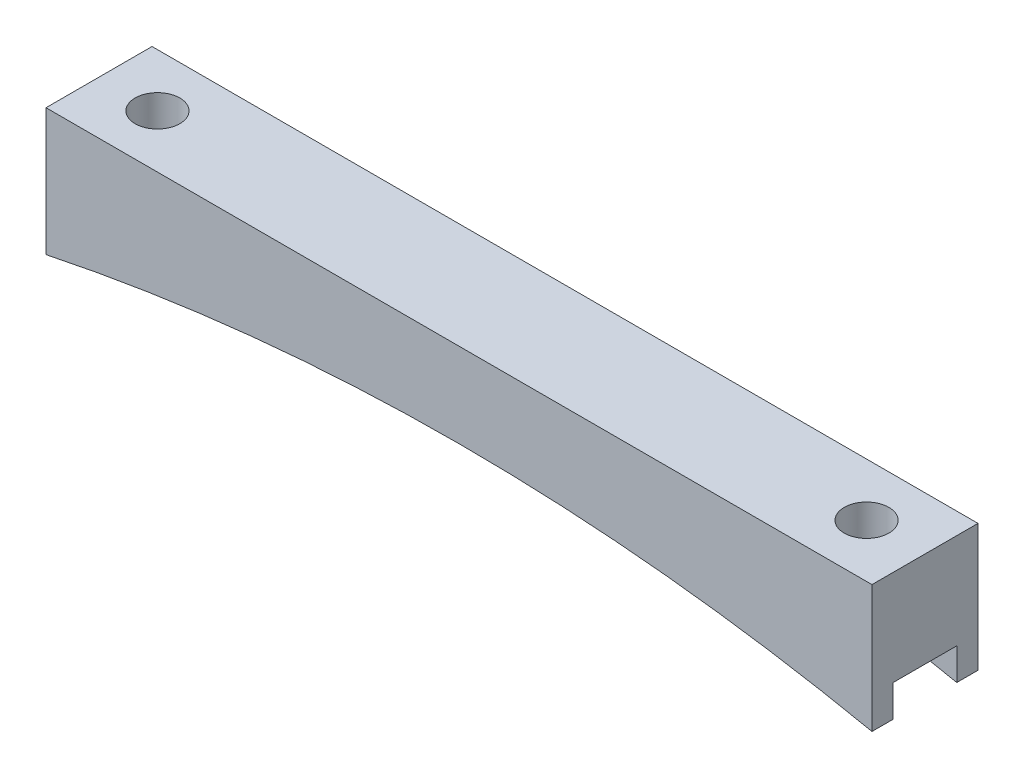
ISO-10303-21;
HEADER;
FILE_DESCRIPTION(('STEP AP214'),'2;1');
FILE_NAME('part.step','',(''),(''),'','','');
FILE_SCHEMA(('AUTOMOTIVE_DESIGN { 1 0 10303 214 1 1 1 1 }'));
ENDSEC;
DATA;
#1=APPLICATION_CONTEXT('core data for automotive mechanical design processes');
#2=APPLICATION_PROTOCOL_DEFINITION('international standard','automotive_design',2000,#1);
#3=PRODUCT_CONTEXT('',#1,'mechanical');
#4=PRODUCT('Part','Part','',(#3));
#5=PRODUCT_RELATED_PRODUCT_CATEGORY('part','',(#4));
#6=PRODUCT_DEFINITION_FORMATION('','',#4);
#7=PRODUCT_DEFINITION_CONTEXT('part definition',#1,'design');
#8=PRODUCT_DEFINITION('design','',#6,#7);
#9=PRODUCT_DEFINITION_SHAPE('','',#8);
#10=(LENGTH_UNIT() NAMED_UNIT(*) SI_UNIT(.MILLI.,.METRE.));
#11=(NAMED_UNIT(*) PLANE_ANGLE_UNIT() SI_UNIT($,.RADIAN.));
#12=(NAMED_UNIT(*) SI_UNIT($,.STERADIAN.) SOLID_ANGLE_UNIT());
#13=UNCERTAINTY_MEASURE_WITH_UNIT(LENGTH_MEASURE(1.E-05),#10,'distance_accuracy_value','');
#14=(GEOMETRIC_REPRESENTATION_CONTEXT(3) GLOBAL_UNCERTAINTY_ASSIGNED_CONTEXT((#13)) GLOBAL_UNIT_ASSIGNED_CONTEXT((#10,
#11,#12)) REPRESENTATION_CONTEXT('',''));
#15=CARTESIAN_POINT('',(0.,0.,0.));
#16=DIRECTION('',(0.,0.,1.));
#17=DIRECTION('',(1.,0.,0.));
#18=AXIS2_PLACEMENT_3D('',#15,#16,#17);
#19=CARTESIAN_POINT('',(49.465,0.,12.7));
#20=DIRECTION('',(-1.,0.,0.));
#21=DIRECTION('',(0.,-1.,0.));
#22=AXIS2_PLACEMENT_3D('',#19,#20,#21);
#23=PLANE('',#22);
#24=DIRECTION('',(0.,0.,-1.));
#25=VECTOR('',#24,1.);
#26=CARTESIAN_POINT('',(49.465,-15.24,12.7));
#27=LINE('',#26,#25);
#28=CARTESIAN_POINT('',(49.465,-15.24,12.7));
#29=VERTEX_POINT('',#28);
#30=CARTESIAN_POINT('',(49.465,-15.24,10.16));
#31=VERTEX_POINT('',#30);
#32=EDGE_CURVE('E156',#29,#31,#27,.T.);
#33=ORIENTED_EDGE('',*,*,#32,.T.);
#34=DIRECTION('',(0.,-1.,0.));
#35=VECTOR('',#34,1.);
#36=CARTESIAN_POINT('',(49.465,-15.24,10.16));
#37=LINE('',#36,#35);
#38=CARTESIAN_POINT('',(49.465,-11.43,10.16));
#39=VERTEX_POINT('',#38);
#40=EDGE_CURVE('E185',#39,#31,#37,.T.);
#41=ORIENTED_EDGE('',*,*,#40,.F.);
#42=DIRECTION('',(0.,0.,1.));
#43=VECTOR('',#42,1.);
#44=CARTESIAN_POINT('',(49.465,-11.43,10.16));
#45=LINE('',#44,#43);
#46=CARTESIAN_POINT('',(49.465,-11.43,2.54));
#47=VERTEX_POINT('',#46);
#48=EDGE_CURVE('E141',#47,#39,#45,.T.);
#49=ORIENTED_EDGE('',*,*,#48,.F.);
#50=DIRECTION('',(0.,1.,0.));
#51=VECTOR('',#50,1.);
#52=CARTESIAN_POINT('',(49.465,-15.24,2.54));
#53=LINE('',#52,#51);
#54=CARTESIAN_POINT('',(49.465,-15.24,2.54));
#55=VERTEX_POINT('',#54);
#56=EDGE_CURVE('E177',#55,#47,#53,.T.);
#57=ORIENTED_EDGE('',*,*,#56,.F.);
#58=CARTESIAN_POINT('',(49.465,-15.24,0.));
#59=VERTEX_POINT('',#58);
#60=EDGE_CURVE('E174',#55,#59,#27,.T.);
#61=ORIENTED_EDGE('',*,*,#60,.T.);
#62=DIRECTION('',(0.,1.,0.));
#63=VECTOR('',#62,1.);
#64=CARTESIAN_POINT('',(49.465,0.,0.));
#65=LINE('',#64,#63);
#66=CARTESIAN_POINT('',(49.465,0.,0.));
#67=VERTEX_POINT('',#66);
#68=EDGE_CURVE('E213',#59,#67,#65,.T.);
#69=ORIENTED_EDGE('',*,*,#68,.T.);
#70=DIRECTION('',(0.,0.,-1.));
#71=VECTOR('',#70,1.);
#72=CARTESIAN_POINT('',(49.465,0.,12.7));
#73=LINE('',#72,#71);
#74=CARTESIAN_POINT('',(49.465,0.,12.7));
#75=VERTEX_POINT('',#74);
#76=EDGE_CURVE('E154',#75,#67,#73,.T.);
#77=ORIENTED_EDGE('',*,*,#76,.F.);
#78=DIRECTION('',(0.,1.,0.));
#79=VECTOR('',#78,1.);
#80=CARTESIAN_POINT('',(49.465,0.,12.7));
#81=LINE('',#80,#79);
#82=EDGE_CURVE('E217',#29,#75,#81,.T.);
#83=ORIENTED_EDGE('',*,*,#82,.F.);
#84=EDGE_LOOP('',(#33,#41,#49,#57,#61,#69,#77,#83));
#85=FACE_BOUND('',#84,.T.);
#86=ADVANCED_FACE('F43',(#85),#23,.F.);
#87=CARTESIAN_POINT('',(-49.465,0.,12.7));
#88=DIRECTION('',(0.,-1.,0.));
#89=DIRECTION('',(1.,0.,0.));
#90=AXIS2_PLACEMENT_3D('',#87,#88,#89);
#91=PLANE('',#90);
#92=CARTESIAN_POINT('',(-42.465,0.,6.35));
#93=DIRECTION('',(0.,1.,0.));
#94=DIRECTION('',(-1.,0.,0.));
#95=AXIS2_PLACEMENT_3D('',#92,#93,#94);
#96=CIRCLE('',#95,2.675);
#97=CARTESIAN_POINT('',(-45.14,0.,6.35));
#98=VERTEX_POINT('',#97);
#99=EDGE_CURVE('E209',#98,#98,#96,.T.);
#100=ORIENTED_EDGE('',*,*,#99,.F.);
#101=EDGE_LOOP('',(#100));
#102=FACE_BOUND('',#101,.T.);
#103=CARTESIAN_POINT('',(42.465,0.,6.35));
#104=DIRECTION('',(0.,1.,0.));
#105=DIRECTION('',(-1.,0.,0.));
#106=AXIS2_PLACEMENT_3D('',#103,#104,#105);
#107=CIRCLE('',#106,2.675);
#108=CARTESIAN_POINT('',(39.79,0.,6.35));
#109=VERTEX_POINT('',#108);
#110=EDGE_CURVE('E208',#109,#109,#107,.T.);
#111=ORIENTED_EDGE('',*,*,#110,.F.);
#112=EDGE_LOOP('',(#111));
#113=FACE_BOUND('',#112,.T.);
#114=DIRECTION('',(-1.,0.,0.));
#115=VECTOR('',#114,1.);
#116=CARTESIAN_POINT('',(-49.465,0.,0.));
#117=LINE('',#116,#115);
#118=CARTESIAN_POINT('',(-49.465,0.,0.));
#119=VERTEX_POINT('',#118);
#120=EDGE_CURVE('E232',#67,#119,#117,.T.);
#121=ORIENTED_EDGE('',*,*,#120,.T.);
#122=DIRECTION('',(0.,0.,-1.));
#123=VECTOR('',#122,1.);
#124=CARTESIAN_POINT('',(-49.465,0.,12.7));
#125=LINE('',#124,#123);
#126=CARTESIAN_POINT('',(-49.465,0.,12.7));
#127=VERTEX_POINT('',#126);
#128=EDGE_CURVE('E148',#127,#119,#125,.T.);
#129=ORIENTED_EDGE('',*,*,#128,.F.);
#130=DIRECTION('',(-1.,0.,0.));
#131=VECTOR('',#130,1.);
#132=CARTESIAN_POINT('',(-49.465,0.,12.7));
#133=LINE('',#132,#131);
#134=EDGE_CURVE('E221',#75,#127,#133,.T.);
#135=ORIENTED_EDGE('',*,*,#134,.F.);
#136=ORIENTED_EDGE('',*,*,#76,.T.);
#137=EDGE_LOOP('',(#121,#129,#135,#136));
#138=FACE_BOUND('',#137,.T.);
#139=ADVANCED_FACE('F247',(#102,#113,#138),#91,.F.);
#140=CARTESIAN_POINT('',(-49.465,0.,12.7));
#141=DIRECTION('',(1.,0.,0.));
#142=DIRECTION('',(0.,1.,0.));
#143=AXIS2_PLACEMENT_3D('',#140,#141,#142);
#144=PLANE('',#143);
#145=DIRECTION('',(0.,0.,1.));
#146=VECTOR('',#145,1.);
#147=CARTESIAN_POINT('',(-49.465,-11.43,10.16));
#148=LINE('',#147,#146);
#149=CARTESIAN_POINT('',(-49.465,-11.43,2.54));
#150=VERTEX_POINT('',#149);
#151=CARTESIAN_POINT('',(-49.465,-11.43,10.16));
#152=VERTEX_POINT('',#151);
#153=EDGE_CURVE('E139',#150,#152,#148,.T.);
#154=ORIENTED_EDGE('',*,*,#153,.T.);
#155=DIRECTION('',(0.,-1.,0.));
#156=VECTOR('',#155,1.);
#157=CARTESIAN_POINT('',(-49.465,-15.24,10.16));
#158=LINE('',#157,#156);
#159=CARTESIAN_POINT('',(-49.465,-15.24,10.16));
#160=VERTEX_POINT('',#159);
#161=EDGE_CURVE('E124',#152,#160,#158,.T.);
#162=ORIENTED_EDGE('',*,*,#161,.T.);
#163=DIRECTION('',(0.,0.,-1.));
#164=VECTOR('',#163,1.);
#165=CARTESIAN_POINT('',(-49.465,-15.24,12.7));
#166=LINE('',#165,#164);
#167=CARTESIAN_POINT('',(-49.465,-15.24,12.7));
#168=VERTEX_POINT('',#167);
#169=EDGE_CURVE('E136',#168,#160,#166,.T.);
#170=ORIENTED_EDGE('',*,*,#169,.F.);
#171=DIRECTION('',(0.,-1.,0.));
#172=VECTOR('',#171,1.);
#173=CARTESIAN_POINT('',(-49.465,0.,12.7));
#174=LINE('',#173,#172);
#175=EDGE_CURVE('E225',#127,#168,#174,.T.);
#176=ORIENTED_EDGE('',*,*,#175,.F.);
#177=ORIENTED_EDGE('',*,*,#128,.T.);
#178=DIRECTION('',(0.,-1.,0.));
#179=VECTOR('',#178,1.);
#180=CARTESIAN_POINT('',(-49.465,0.,0.));
#181=LINE('',#180,#179);
#182=CARTESIAN_POINT('',(-49.465,-15.24,0.));
#183=VERTEX_POINT('',#182);
#184=EDGE_CURVE('E235',#119,#183,#181,.T.);
#185=ORIENTED_EDGE('',*,*,#184,.T.);
#186=CARTESIAN_POINT('',(-49.465,-15.24,2.54));
#187=VERTEX_POINT('',#186);
#188=EDGE_CURVE('E149',#187,#183,#166,.T.);
#189=ORIENTED_EDGE('',*,*,#188,.F.);
#190=DIRECTION('',(0.,1.,0.));
#191=VECTOR('',#190,1.);
#192=CARTESIAN_POINT('',(-49.465,-15.24,2.54));
#193=LINE('',#192,#191);
#194=EDGE_CURVE('E67',#187,#150,#193,.T.);
#195=ORIENTED_EDGE('',*,*,#194,.T.);
#196=EDGE_LOOP('',(#154,#162,#170,#176,#177,#185,#189,#195));
#197=FACE_BOUND('',#196,.T.);
#198=ADVANCED_FACE('F134',(#197),#144,.F.);
#199=CARTESIAN_POINT('',(0.,-251.415578278111,12.7));
#200=DIRECTION('',(0.,0.,-1.));
#201=DIRECTION('',(-1.,0.,0.));
#202=AXIS2_PLACEMENT_3D('',#199,#200,#201);
#203=CYLINDRICAL_SURFACE('',#202,241.3);
#204=DIRECTION('',(0.,0.,-1.));
#205=VECTOR('',#204,1.);
#206=CARTESIAN_POINT('',(25.1517836051595,-11.4299999999999,12.7));
#207=LINE('',#206,#205);
#208=CARTESIAN_POINT('',(25.1517836051595,-11.4299999999999,2.54));
#209=VERTEX_POINT('',#208);
#210=CARTESIAN_POINT('',(25.1517836051595,-11.43,10.16));
#211=VERTEX_POINT('',#210);
#212=EDGE_CURVE('E172',#209,#211,#207,.F.);
#213=ORIENTED_EDGE('',*,*,#212,.T.);
#214=CARTESIAN_POINT('',(0.,-251.415578278111,10.16));
#215=DIRECTION('',(0.,0.,1.));
#216=DIRECTION('',(1.,0.,0.));
#217=AXIS2_PLACEMENT_3D('',#214,#215,#216);
#218=CIRCLE('',#217,241.3);
#219=EDGE_CURVE('E11',#211,#31,#218,.F.);
#220=ORIENTED_EDGE('',*,*,#219,.T.);
#221=ORIENTED_EDGE('',*,*,#32,.F.);
#222=CARTESIAN_POINT('',(0.,-251.415578278111,12.7));
#223=DIRECTION('',(0.,0.,-1.));
#224=DIRECTION('',(-1.,0.,0.));
#225=AXIS2_PLACEMENT_3D('',#222,#223,#224);
#226=CIRCLE('',#225,241.3);
#227=EDGE_CURVE('E146',#168,#29,#226,.T.);
#228=ORIENTED_EDGE('',*,*,#227,.F.);
#229=ORIENTED_EDGE('',*,*,#169,.T.);
#230=CARTESIAN_POINT('',(-25.1517836051595,-11.43,10.16));
#231=VERTEX_POINT('',#230);
#232=EDGE_CURVE('E46',#160,#231,#218,.F.);
#233=ORIENTED_EDGE('',*,*,#232,.T.);
#234=DIRECTION('',(0.,0.,-1.));
#235=VECTOR('',#234,1.);
#236=CARTESIAN_POINT('',(-25.1517836051595,-11.4299999999999,12.7));
#237=LINE('',#236,#235);
#238=CARTESIAN_POINT('',(-25.1517836051595,-11.4299999999999,2.54));
#239=VERTEX_POINT('',#238);
#240=EDGE_CURVE('E203',#231,#239,#237,.T.);
#241=ORIENTED_EDGE('',*,*,#240,.T.);
#242=CARTESIAN_POINT('',(0.,-251.415578278111,2.54));
#243=DIRECTION('',(0.,0.,-1.));
#244=DIRECTION('',(-1.,0.,0.));
#245=AXIS2_PLACEMENT_3D('',#242,#243,#244);
#246=CIRCLE('',#245,241.3);
#247=EDGE_CURVE('E131',#239,#187,#246,.F.);
#248=ORIENTED_EDGE('',*,*,#247,.T.);
#249=ORIENTED_EDGE('',*,*,#188,.T.);
#250=CARTESIAN_POINT('',(0.,-251.415578278111,0.));
#251=DIRECTION('',(0.,0.,-1.));
#252=DIRECTION('',(-1.,0.,0.));
#253=AXIS2_PLACEMENT_3D('',#250,#251,#252);
#254=CIRCLE('',#253,241.3);
#255=EDGE_CURVE('E222',#183,#59,#254,.T.);
#256=ORIENTED_EDGE('',*,*,#255,.T.);
#257=ORIENTED_EDGE('',*,*,#60,.F.);
#258=EDGE_CURVE('E52',#55,#209,#246,.F.);
#259=ORIENTED_EDGE('',*,*,#258,.T.);
#260=EDGE_LOOP('',(#213,#220,#221,#228,#229,#233,#241,#248,#249,#256,#257,#259));
#261=FACE_BOUND('',#260,.T.);
#262=ADVANCED_FACE('F144',(#261),#203,.F.);
#263=CARTESIAN_POINT('',(0.,-251.415578278111,12.7));
#264=DIRECTION('',(0.,0.,-1.));
#265=DIRECTION('',(-1.,0.,0.));
#266=AXIS2_PLACEMENT_3D('',#263,#264,#265);
#267=PLANE('',#266);
#268=ORIENTED_EDGE('',*,*,#82,.T.);
#269=ORIENTED_EDGE('',*,*,#134,.T.);
#270=ORIENTED_EDGE('',*,*,#175,.T.);
#271=ORIENTED_EDGE('',*,*,#227,.T.);
#272=EDGE_LOOP('',(#268,#269,#270,#271));
#273=FACE_BOUND('',#272,.T.);
#274=ADVANCED_FACE('F250',(#273),#267,.F.);
#275=CARTESIAN_POINT('',(0.,-251.415578278111,0.));
#276=DIRECTION('',(0.,0.,-1.));
#277=DIRECTION('',(-1.,0.,0.));
#278=AXIS2_PLACEMENT_3D('',#275,#276,#277);
#279=PLANE('',#278);
#280=ORIENTED_EDGE('',*,*,#68,.F.);
#281=ORIENTED_EDGE('',*,*,#255,.F.);
#282=ORIENTED_EDGE('',*,*,#184,.F.);
#283=ORIENTED_EDGE('',*,*,#120,.F.);
#284=EDGE_LOOP('',(#280,#281,#282,#283));
#285=FACE_BOUND('',#284,.T.);
#286=ADVANCED_FACE('F243',(#285),#279,.T.);
#287=CARTESIAN_POINT('',(42.465,-15.24,6.35));
#288=DIRECTION('',(0.,1.,0.));
#289=DIRECTION('',(-1.,0.,0.));
#290=AXIS2_PLACEMENT_3D('',#287,#288,#289);
#291=CYLINDRICAL_SURFACE('',#290,2.675);
#292=CARTESIAN_POINT('',(42.465,-11.43,6.35));
#293=DIRECTION('',(0.,1.,0.));
#294=DIRECTION('',(0.,0.,1.));
#295=AXIS2_PLACEMENT_3D('',#292,#293,#294);
#296=CIRCLE('',#295,2.675);
#297=CARTESIAN_POINT('',(42.465,-11.43,9.025));
#298=VERTEX_POINT('',#297);
#299=EDGE_CURVE('E166',#298,#298,#296,.F.);
#300=ORIENTED_EDGE('',*,*,#299,.T.);
#301=EDGE_LOOP('',(#300));
#302=FACE_BOUND('',#301,.T.);
#303=ORIENTED_EDGE('',*,*,#110,.T.);
#304=EDGE_LOOP('',(#303));
#305=FACE_BOUND('',#304,.T.);
#306=ADVANCED_FACE('F292',(#302,#305),#291,.F.);
#307=CARTESIAN_POINT('',(-42.465,-15.24,6.35));
#308=DIRECTION('',(0.,1.,0.));
#309=DIRECTION('',(-1.,0.,0.));
#310=AXIS2_PLACEMENT_3D('',#307,#308,#309);
#311=CYLINDRICAL_SURFACE('',#310,2.675);
#312=CARTESIAN_POINT('',(-42.465,-11.43,6.35));
#313=DIRECTION('',(0.,1.,0.));
#314=DIRECTION('',(0.,0.,1.));
#315=AXIS2_PLACEMENT_3D('',#312,#313,#314);
#316=CIRCLE('',#315,2.675);
#317=CARTESIAN_POINT('',(-42.465,-11.43,9.025));
#318=VERTEX_POINT('',#317);
#319=EDGE_CURVE('E163',#318,#318,#316,.F.);
#320=ORIENTED_EDGE('',*,*,#319,.T.);
#321=EDGE_LOOP('',(#320));
#322=FACE_BOUND('',#321,.T.);
#323=ORIENTED_EDGE('',*,*,#99,.T.);
#324=EDGE_LOOP('',(#323));
#325=FACE_BOUND('',#324,.T.);
#326=ADVANCED_FACE('F274',(#322,#325),#311,.F.);
#327=CARTESIAN_POINT('',(-49.465,-11.43,10.16));
#328=DIRECTION('',(0.,1.,0.));
#329=DIRECTION('',(0.,0.,1.));
#330=AXIS2_PLACEMENT_3D('',#327,#328,#329);
#331=PLANE('',#330);
#332=ORIENTED_EDGE('',*,*,#319,.F.);
#333=EDGE_LOOP('',(#332));
#334=FACE_BOUND('',#333,.T.);
#335=DIRECTION('',(1.,0.,0.));
#336=VECTOR('',#335,1.);
#337=CARTESIAN_POINT('',(-49.465,-11.43,10.16));
#338=LINE('',#337,#336);
#339=EDGE_CURVE('E126',#152,#231,#338,.T.);
#340=ORIENTED_EDGE('',*,*,#339,.F.);
#341=ORIENTED_EDGE('',*,*,#153,.F.);
#342=DIRECTION('',(1.,0.,0.));
#343=VECTOR('',#342,1.);
#344=CARTESIAN_POINT('',(-49.465,-11.43,2.54));
#345=LINE('',#344,#343);
#346=EDGE_CURVE('E196',#150,#239,#345,.T.);
#347=ORIENTED_EDGE('',*,*,#346,.T.);
#348=ORIENTED_EDGE('',*,*,#240,.F.);
#349=EDGE_LOOP('',(#340,#341,#347,#348));
#350=FACE_BOUND('',#349,.T.);
#351=ADVANCED_FACE('F266',(#334,#350),#331,.F.);
#352=CARTESIAN_POINT('',(-49.465,-15.24,2.54));
#353=DIRECTION('',(0.,0.,-1.));
#354=DIRECTION('',(-1.,0.,0.));
#355=AXIS2_PLACEMENT_3D('',#352,#353,#354);
#356=PLANE('',#355);
#357=ORIENTED_EDGE('',*,*,#346,.F.);
#358=ORIENTED_EDGE('',*,*,#194,.F.);
#359=ORIENTED_EDGE('',*,*,#247,.F.);
#360=EDGE_LOOP('',(#357,#358,#359));
#361=FACE_BOUND('',#360,.T.);
#362=ADVANCED_FACE('F271',(#361),#356,.F.);
#363=CARTESIAN_POINT('',(-49.465,-15.24,10.16));
#364=DIRECTION('',(0.,0.,1.));
#365=DIRECTION('',(1.,0.,0.));
#366=AXIS2_PLACEMENT_3D('',#363,#364,#365);
#367=PLANE('',#366);
#368=ORIENTED_EDGE('',*,*,#161,.F.);
#369=ORIENTED_EDGE('',*,*,#339,.T.);
#370=ORIENTED_EDGE('',*,*,#232,.F.);
#371=EDGE_LOOP('',(#368,#369,#370));
#372=FACE_BOUND('',#371,.T.);
#373=ADVANCED_FACE('F123',(#372),#367,.F.);
#374=EDGE_CURVE('E195',#211,#39,#338,.T.);
#375=ORIENTED_EDGE('',*,*,#374,.T.);
#376=ORIENTED_EDGE('',*,*,#40,.T.);
#377=ORIENTED_EDGE('',*,*,#219,.F.);
#378=EDGE_LOOP('',(#375,#376,#377));
#379=FACE_BOUND('',#378,.T.);
#380=ADVANCED_FACE('F254',(#379),#367,.F.);
#381=ORIENTED_EDGE('',*,*,#56,.T.);
#382=EDGE_CURVE('E59',#209,#47,#345,.T.);
#383=ORIENTED_EDGE('',*,*,#382,.F.);
#384=ORIENTED_EDGE('',*,*,#258,.F.);
#385=EDGE_LOOP('',(#381,#383,#384));
#386=FACE_BOUND('',#385,.T.);
#387=ADVANCED_FACE('F176',(#386),#356,.F.);
#388=ORIENTED_EDGE('',*,*,#299,.F.);
#389=EDGE_LOOP('',(#388));
#390=FACE_BOUND('',#389,.T.);
#391=ORIENTED_EDGE('',*,*,#382,.T.);
#392=ORIENTED_EDGE('',*,*,#48,.T.);
#393=ORIENTED_EDGE('',*,*,#374,.F.);
#394=ORIENTED_EDGE('',*,*,#212,.F.);
#395=EDGE_LOOP('',(#391,#392,#393,#394));
#396=FACE_BOUND('',#395,.T.);
#397=ADVANCED_FACE('F258',(#390,#396),#331,.F.);
#398=CLOSED_SHELL('',(#86,#139,#198,#262,#274,#286,#306,#326,#351,#362,#373,#380,#387,#397));
#399=MANIFOLD_SOLID_BREP('B2',#398);
#400=ADVANCED_BREP_SHAPE_REPRESENTATION('',(#18,#399),#14);
#401=SHAPE_DEFINITION_REPRESENTATION(#9,#400);
ENDSEC;
END-ISO-10303-21;
